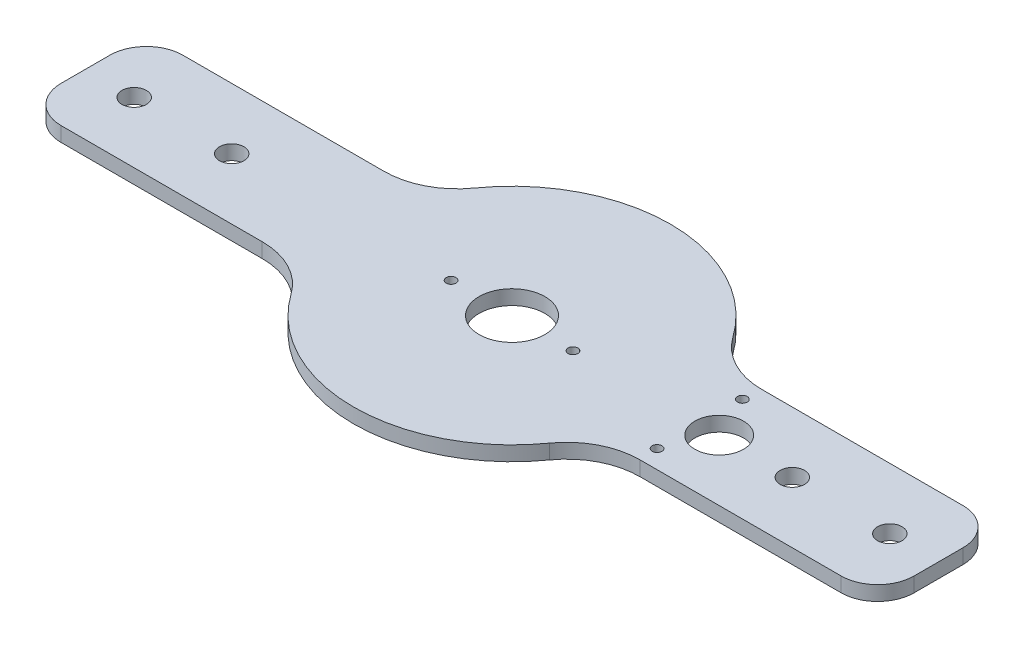
ISO-10303-21;
HEADER;
FILE_DESCRIPTION(('STEP AP214'),'2;1');
FILE_NAME('part.step','',(''),(''),'','','');
FILE_SCHEMA(('AUTOMOTIVE_DESIGN { 1 0 10303 214 1 1 1 1 }'));
ENDSEC;
DATA;
#1=APPLICATION_CONTEXT('core data for automotive mechanical design processes');
#2=APPLICATION_PROTOCOL_DEFINITION('international standard','automotive_design',2000,#1);
#3=PRODUCT_CONTEXT('',#1,'mechanical');
#4=PRODUCT('Part','Part','',(#3));
#5=PRODUCT_RELATED_PRODUCT_CATEGORY('part','',(#4));
#6=PRODUCT_DEFINITION_FORMATION('','',#4);
#7=PRODUCT_DEFINITION_CONTEXT('part definition',#1,'design');
#8=PRODUCT_DEFINITION('design','',#6,#7);
#9=PRODUCT_DEFINITION_SHAPE('','',#8);
#10=(LENGTH_UNIT() NAMED_UNIT(*) SI_UNIT(.MILLI.,.METRE.));
#11=(NAMED_UNIT(*) PLANE_ANGLE_UNIT() SI_UNIT($,.RADIAN.));
#12=(NAMED_UNIT(*) SI_UNIT($,.STERADIAN.) SOLID_ANGLE_UNIT());
#13=UNCERTAINTY_MEASURE_WITH_UNIT(LENGTH_MEASURE(1.E-05),#10,'distance_accuracy_value','');
#14=(GEOMETRIC_REPRESENTATION_CONTEXT(3) GLOBAL_UNCERTAINTY_ASSIGNED_CONTEXT((#13)) GLOBAL_UNIT_ASSIGNED_CONTEXT((#10,
#11,#12)) REPRESENTATION_CONTEXT('',''));
#15=CARTESIAN_POINT('',(0.,0.,0.));
#16=DIRECTION('',(0.,0.,1.));
#17=DIRECTION('',(1.,0.,0.));
#18=AXIS2_PLACEMENT_3D('',#15,#16,#17);
#19=CARTESIAN_POINT('',(-77.4596669241483,6.,-55.));
#20=DIRECTION('',(0.,-1.,0.));
#21=DIRECTION('',(0.,0.,-1.));
#22=AXIS2_PLACEMENT_3D('',#19,#20,#21);
#23=PLANE('',#22);
#24=CARTESIAN_POINT('',(77.,6.,-17.5));
#25=DIRECTION('',(0.,1.,0.));
#26=DIRECTION('',(0.,0.,1.));
#27=AXIS2_PLACEMENT_3D('',#24,#25,#26);
#28=CIRCLE('',#27,2.);
#29=CARTESIAN_POINT('',(77.,6.,-15.5));
#30=VERTEX_POINT('',#29);
#31=EDGE_CURVE('E382',#30,#30,#28,.T.);
#32=ORIENTED_EDGE('',*,*,#31,.F.);
#33=EDGE_LOOP('',(#32));
#34=FACE_BOUND('',#33,.T.);
#35=CARTESIAN_POINT('',(-25.,6.,0.));
#36=DIRECTION('',(0.,1.,0.));
#37=DIRECTION('',(0.,0.,1.));
#38=AXIS2_PLACEMENT_3D('',#35,#36,#37);
#39=CIRCLE('',#38,2.);
#40=CARTESIAN_POINT('',(-25.,6.,2.00000000000001));
#41=VERTEX_POINT('',#40);
#42=EDGE_CURVE('E394',#41,#41,#39,.T.);
#43=ORIENTED_EDGE('',*,*,#42,.F.);
#44=EDGE_LOOP('',(#43));
#45=FACE_BOUND('',#44,.T.);
#46=CARTESIAN_POINT('',(115.,6.,0.));
#47=DIRECTION('',(0.,1.,0.));
#48=DIRECTION('',(0.,0.,-1.));
#49=AXIS2_PLACEMENT_3D('',#46,#47,#48);
#50=CIRCLE('',#49,4.99999999999999);
#51=CARTESIAN_POINT('',(115.,6.,-5.));
#52=VERTEX_POINT('',#51);
#53=EDGE_CURVE('E406',#52,#52,#50,.T.);
#54=ORIENTED_EDGE('',*,*,#53,.F.);
#55=EDGE_LOOP('',(#54));
#56=FACE_BOUND('',#55,.T.);
#57=CARTESIAN_POINT('',(-155.,6.,0.));
#58=DIRECTION('',(0.,1.,0.));
#59=DIRECTION('',(0.,0.,1.));
#60=AXIS2_PLACEMENT_3D('',#57,#58,#59);
#61=CIRCLE('',#60,4.99999999999999);
#62=CARTESIAN_POINT('',(-155.,6.,5.00000000000001));
#63=VERTEX_POINT('',#62);
#64=EDGE_CURVE('E418',#63,#63,#61,.T.);
#65=ORIENTED_EDGE('',*,*,#64,.F.);
#66=EDGE_LOOP('',(#65));
#67=FACE_BOUND('',#66,.T.);
#68=CARTESIAN_POINT('',(0.,6.,0.));
#69=DIRECTION('',(0.,1.,0.));
#70=DIRECTION('',(0.,0.,1.));
#71=AXIS2_PLACEMENT_3D('',#68,#69,#70);
#72=CIRCLE('',#71,13.5);
#73=CARTESIAN_POINT('',(0.,6.,13.5));
#74=VERTEX_POINT('',#73);
#75=EDGE_CURVE('E196',#74,#74,#72,.T.);
#76=ORIENTED_EDGE('',*,*,#75,.F.);
#77=EDGE_LOOP('',(#76));
#78=FACE_BOUND('',#77,.T.);
#79=CARTESIAN_POINT('',(-77.4596669241483,6.,-55.));
#80=DIRECTION('',(0.,-1.,0.));
#81=DIRECTION('',(0.,0.,-1.));
#82=AXIS2_PLACEMENT_3D('',#79,#80,#81);
#83=CIRCLE('',#82,30.);
#84=CARTESIAN_POINT('',(-52.9987194744173,6.,-37.6315789473684));
#85=VERTEX_POINT('',#84);
#86=CARTESIAN_POINT('',(-77.4596669241483,6.,-25.));
#87=VERTEX_POINT('',#86);
#88=EDGE_CURVE('E223',#85,#87,#83,.T.);
#89=ORIENTED_EDGE('',*,*,#88,.T.);
#90=DIRECTION('',(-1.,0.,0.));
#91=VECTOR('',#90,1.);
#92=CARTESIAN_POINT('',(-160.,6.,-25.));
#93=LINE('',#92,#91);
#94=CARTESIAN_POINT('',(-160.,6.,-25.));
#95=VERTEX_POINT('',#94);
#96=EDGE_CURVE('E131',#87,#95,#93,.T.);
#97=ORIENTED_EDGE('',*,*,#96,.T.);
#98=CARTESIAN_POINT('',(-160.,6.,-10.));
#99=DIRECTION('',(0.,1.,0.));
#100=DIRECTION('',(0.,0.,1.));
#101=AXIS2_PLACEMENT_3D('',#98,#99,#100);
#102=CIRCLE('',#101,15.);
#103=CARTESIAN_POINT('',(-175.,6.,-10.));
#104=VERTEX_POINT('',#103);
#105=EDGE_CURVE('E262',#95,#104,#102,.T.);
#106=ORIENTED_EDGE('',*,*,#105,.T.);
#107=DIRECTION('',(0.,0.,1.));
#108=VECTOR('',#107,1.);
#109=CARTESIAN_POINT('',(-175.,6.,-10.));
#110=LINE('',#109,#108);
#111=CARTESIAN_POINT('',(-175.,6.,10.));
#112=VERTEX_POINT('',#111);
#113=EDGE_CURVE('E281',#104,#112,#110,.T.);
#114=ORIENTED_EDGE('',*,*,#113,.T.);
#115=CARTESIAN_POINT('',(-160.,6.,10.));
#116=DIRECTION('',(0.,1.,0.));
#117=DIRECTION('',(0.,0.,-1.));
#118=AXIS2_PLACEMENT_3D('',#115,#116,#117);
#119=CIRCLE('',#118,15.);
#120=CARTESIAN_POINT('',(-160.,6.,25.));
#121=VERTEX_POINT('',#120);
#122=EDGE_CURVE('E278',#112,#121,#119,.T.);
#123=ORIENTED_EDGE('',*,*,#122,.T.);
#124=DIRECTION('',(1.,0.,0.));
#125=VECTOR('',#124,1.);
#126=CARTESIAN_POINT('',(-160.,6.,25.));
#127=LINE('',#126,#125);
#128=CARTESIAN_POINT('',(-77.4596669241483,6.,25.));
#129=VERTEX_POINT('',#128);
#130=EDGE_CURVE('E280',#121,#129,#127,.T.);
#131=ORIENTED_EDGE('',*,*,#130,.T.);
#132=CARTESIAN_POINT('',(-77.4596669241483,6.,55.));
#133=DIRECTION('',(0.,-1.,0.));
#134=DIRECTION('',(0.,0.,1.));
#135=AXIS2_PLACEMENT_3D('',#132,#133,#134);
#136=CIRCLE('',#135,30.);
#137=CARTESIAN_POINT('',(-52.9987194744173,6.,37.6315789473684));
#138=VERTEX_POINT('',#137);
#139=EDGE_CURVE('E283',#129,#138,#136,.T.);
#140=ORIENTED_EDGE('',*,*,#139,.T.);
#141=CARTESIAN_POINT('',(0.,6.,0.));
#142=DIRECTION('',(0.,1.,0.));
#143=DIRECTION('',(0.,0.,1.));
#144=AXIS2_PLACEMENT_3D('',#141,#142,#143);
#145=CIRCLE('',#144,65.);
#146=CARTESIAN_POINT('',(52.9987194744173,6.,37.6315789473684));
#147=VERTEX_POINT('',#146);
#148=EDGE_CURVE('E289',#138,#147,#145,.T.);
#149=ORIENTED_EDGE('',*,*,#148,.T.);
#150=CARTESIAN_POINT('',(77.4596669241483,6.,55.));
#151=DIRECTION('',(0.,-1.,0.));
#152=DIRECTION('',(0.,0.,1.));
#153=AXIS2_PLACEMENT_3D('',#150,#151,#152);
#154=CIRCLE('',#153,30.);
#155=CARTESIAN_POINT('',(77.4596669241483,6.,25.));
#156=VERTEX_POINT('',#155);
#157=EDGE_CURVE('E291',#147,#156,#154,.T.);
#158=ORIENTED_EDGE('',*,*,#157,.T.);
#159=DIRECTION('',(1.,0.,0.));
#160=VECTOR('',#159,1.);
#161=CARTESIAN_POINT('',(77.4596669241483,6.,25.));
#162=LINE('',#161,#160);
#163=CARTESIAN_POINT('',(160.,6.,25.));
#164=VERTEX_POINT('',#163);
#165=EDGE_CURVE('E293',#156,#164,#162,.T.);
#166=ORIENTED_EDGE('',*,*,#165,.T.);
#167=CARTESIAN_POINT('',(160.,6.,10.));
#168=DIRECTION('',(0.,1.,0.));
#169=DIRECTION('',(0.,0.,-1.));
#170=AXIS2_PLACEMENT_3D('',#167,#168,#169);
#171=CIRCLE('',#170,15.);
#172=CARTESIAN_POINT('',(175.,6.,10.));
#173=VERTEX_POINT('',#172);
#174=EDGE_CURVE('E295',#164,#173,#171,.T.);
#175=ORIENTED_EDGE('',*,*,#174,.T.);
#176=DIRECTION('',(0.,0.,-1.));
#177=VECTOR('',#176,1.);
#178=CARTESIAN_POINT('',(175.,6.,-10.));
#179=LINE('',#178,#177);
#180=CARTESIAN_POINT('',(175.,6.,-10.));
#181=VERTEX_POINT('',#180);
#182=EDGE_CURVE('E297',#173,#181,#179,.T.);
#183=ORIENTED_EDGE('',*,*,#182,.T.);
#184=CARTESIAN_POINT('',(160.,6.,-10.));
#185=DIRECTION('',(0.,1.,0.));
#186=DIRECTION('',(0.,0.,1.));
#187=AXIS2_PLACEMENT_3D('',#184,#185,#186);
#188=CIRCLE('',#187,15.);
#189=CARTESIAN_POINT('',(160.,6.,-25.));
#190=VERTEX_POINT('',#189);
#191=EDGE_CURVE('E174',#181,#190,#188,.T.);
#192=ORIENTED_EDGE('',*,*,#191,.T.);
#193=DIRECTION('',(-1.,0.,0.));
#194=VECTOR('',#193,1.);
#195=CARTESIAN_POINT('',(77.4596669241483,6.,-25.));
#196=LINE('',#195,#194);
#197=CARTESIAN_POINT('',(77.4596669241483,6.,-25.));
#198=VERTEX_POINT('',#197);
#199=EDGE_CURVE('E168',#190,#198,#196,.T.);
#200=ORIENTED_EDGE('',*,*,#199,.T.);
#201=CARTESIAN_POINT('',(77.4596669241483,6.,-55.));
#202=DIRECTION('',(0.,-1.,0.));
#203=DIRECTION('',(0.,0.,-1.));
#204=AXIS2_PLACEMENT_3D('',#201,#202,#203);
#205=CIRCLE('',#204,30.);
#206=CARTESIAN_POINT('',(52.9987194744173,6.,-37.6315789473684));
#207=VERTEX_POINT('',#206);
#208=EDGE_CURVE('E172',#198,#207,#205,.T.);
#209=ORIENTED_EDGE('',*,*,#208,.T.);
#210=CARTESIAN_POINT('',(0.,6.,0.));
#211=DIRECTION('',(0.,1.,0.));
#212=DIRECTION('',(0.,0.,1.));
#213=AXIS2_PLACEMENT_3D('',#210,#211,#212);
#214=CIRCLE('',#213,65.);
#215=EDGE_CURVE('E64',#207,#85,#214,.T.);
#216=ORIENTED_EDGE('',*,*,#215,.T.);
#217=EDGE_LOOP('',(#89,#97,#106,#114,#123,#131,#140,#149,#158,#166,#175,#183,#192,#200,#209,#216));
#218=FACE_BOUND('',#217,.T.);
#219=CARTESIAN_POINT('',(-115.,6.,0.));
#220=DIRECTION('',(0.,1.,0.));
#221=DIRECTION('',(0.,0.,1.));
#222=AXIS2_PLACEMENT_3D('',#219,#220,#221);
#223=CIRCLE('',#222,4.99999999999999);
#224=CARTESIAN_POINT('',(-115.,6.,5.));
#225=VERTEX_POINT('',#224);
#226=EDGE_CURVE('E424',#225,#225,#223,.T.);
#227=ORIENTED_EDGE('',*,*,#226,.F.);
#228=EDGE_LOOP('',(#227));
#229=FACE_BOUND('',#228,.T.);
#230=CARTESIAN_POINT('',(155.,6.,0.));
#231=DIRECTION('',(0.,1.,0.));
#232=DIRECTION('',(0.,0.,-1.));
#233=AXIS2_PLACEMENT_3D('',#230,#231,#232);
#234=CIRCLE('',#233,4.99999999999999);
#235=CARTESIAN_POINT('',(155.,6.,-5.00000000000001));
#236=VERTEX_POINT('',#235);
#237=EDGE_CURVE('E412',#236,#236,#234,.T.);
#238=ORIENTED_EDGE('',*,*,#237,.F.);
#239=EDGE_LOOP('',(#238));
#240=FACE_BOUND('',#239,.T.);
#241=CARTESIAN_POINT('',(85.,6.,0.));
#242=DIRECTION('',(0.,1.,0.));
#243=DIRECTION('',(0.,0.,1.));
#244=AXIS2_PLACEMENT_3D('',#241,#242,#243);
#245=CIRCLE('',#244,9.99999999999999);
#246=CARTESIAN_POINT('',(85.,6.,9.99999999999999));
#247=VERTEX_POINT('',#246);
#248=EDGE_CURVE('E400',#247,#247,#245,.T.);
#249=ORIENTED_EDGE('',*,*,#248,.F.);
#250=EDGE_LOOP('',(#249));
#251=FACE_BOUND('',#250,.T.);
#252=CARTESIAN_POINT('',(25.,6.,0.));
#253=DIRECTION('',(0.,1.,0.));
#254=DIRECTION('',(0.,0.,-1.));
#255=AXIS2_PLACEMENT_3D('',#252,#253,#254);
#256=CIRCLE('',#255,2.);
#257=CARTESIAN_POINT('',(25.,6.,-2.));
#258=VERTEX_POINT('',#257);
#259=EDGE_CURVE('E388',#258,#258,#256,.T.);
#260=ORIENTED_EDGE('',*,*,#259,.F.);
#261=EDGE_LOOP('',(#260));
#262=FACE_BOUND('',#261,.T.);
#263=CARTESIAN_POINT('',(77.,6.,17.5));
#264=DIRECTION('',(0.,1.,0.));
#265=DIRECTION('',(0.,0.,-1.));
#266=AXIS2_PLACEMENT_3D('',#263,#264,#265);
#267=CIRCLE('',#266,2.);
#268=CARTESIAN_POINT('',(77.,6.,15.5));
#269=VERTEX_POINT('',#268);
#270=EDGE_CURVE('E373',#269,#269,#267,.T.);
#271=ORIENTED_EDGE('',*,*,#270,.F.);
#272=EDGE_LOOP('',(#271));
#273=FACE_BOUND('',#272,.T.);
#274=ADVANCED_FACE('F47',(#34,#45,#56,#67,#78,#218,#229,#240,#251,#262,#273),#23,.F.);
#275=CARTESIAN_POINT('',(-77.4596669241483,0.,-55.));
#276=DIRECTION('',(0.,-1.,0.));
#277=DIRECTION('',(0.,0.,-1.));
#278=AXIS2_PLACEMENT_3D('',#275,#276,#277);
#279=PLANE('',#278);
#280=CARTESIAN_POINT('',(77.,0.,-17.5));
#281=DIRECTION('',(0.,1.,0.));
#282=DIRECTION('',(0.,0.,1.));
#283=AXIS2_PLACEMENT_3D('',#280,#281,#282);
#284=CIRCLE('',#283,2.);
#285=CARTESIAN_POINT('',(77.,0.,-15.5));
#286=VERTEX_POINT('',#285);
#287=EDGE_CURVE('E379',#286,#286,#284,.T.);
#288=ORIENTED_EDGE('',*,*,#287,.T.);
#289=EDGE_LOOP('',(#288));
#290=FACE_BOUND('',#289,.T.);
#291=CARTESIAN_POINT('',(-25.,0.,0.));
#292=DIRECTION('',(0.,1.,0.));
#293=DIRECTION('',(0.,0.,1.));
#294=AXIS2_PLACEMENT_3D('',#291,#292,#293);
#295=CIRCLE('',#294,2.);
#296=CARTESIAN_POINT('',(-25.,0.,2.00000000000001));
#297=VERTEX_POINT('',#296);
#298=EDGE_CURVE('E391',#297,#297,#295,.T.);
#299=ORIENTED_EDGE('',*,*,#298,.T.);
#300=EDGE_LOOP('',(#299));
#301=FACE_BOUND('',#300,.T.);
#302=CARTESIAN_POINT('',(115.,0.,0.));
#303=DIRECTION('',(0.,1.,0.));
#304=DIRECTION('',(0.,0.,-1.));
#305=AXIS2_PLACEMENT_3D('',#302,#303,#304);
#306=CIRCLE('',#305,4.99999999999999);
#307=CARTESIAN_POINT('',(115.,0.,-5.));
#308=VERTEX_POINT('',#307);
#309=EDGE_CURVE('E403',#308,#308,#306,.T.);
#310=ORIENTED_EDGE('',*,*,#309,.T.);
#311=EDGE_LOOP('',(#310));
#312=FACE_BOUND('',#311,.T.);
#313=CARTESIAN_POINT('',(-155.,0.,0.));
#314=DIRECTION('',(0.,1.,0.));
#315=DIRECTION('',(0.,0.,1.));
#316=AXIS2_PLACEMENT_3D('',#313,#314,#315);
#317=CIRCLE('',#316,4.99999999999999);
#318=CARTESIAN_POINT('',(-155.,0.,5.00000000000001));
#319=VERTEX_POINT('',#318);
#320=EDGE_CURVE('E415',#319,#319,#317,.T.);
#321=ORIENTED_EDGE('',*,*,#320,.T.);
#322=EDGE_LOOP('',(#321));
#323=FACE_BOUND('',#322,.T.);
#324=CARTESIAN_POINT('',(0.,0.,0.));
#325=DIRECTION('',(0.,1.,0.));
#326=DIRECTION('',(0.,0.,1.));
#327=AXIS2_PLACEMENT_3D('',#324,#325,#326);
#328=CIRCLE('',#327,13.5);
#329=CARTESIAN_POINT('',(0.,0.,13.5));
#330=VERTEX_POINT('',#329);
#331=EDGE_CURVE('E427',#330,#330,#328,.T.);
#332=ORIENTED_EDGE('',*,*,#331,.T.);
#333=EDGE_LOOP('',(#332));
#334=FACE_BOUND('',#333,.T.);
#335=CARTESIAN_POINT('',(-77.4596669241483,0.,-55.));
#336=DIRECTION('',(0.,-1.,0.));
#337=DIRECTION('',(0.,0.,-1.));
#338=AXIS2_PLACEMENT_3D('',#335,#336,#337);
#339=CIRCLE('',#338,30.);
#340=CARTESIAN_POINT('',(-52.9987194744173,0.,-37.6315789473684));
#341=VERTEX_POINT('',#340);
#342=CARTESIAN_POINT('',(-77.4596669241483,0.,-25.));
#343=VERTEX_POINT('',#342);
#344=EDGE_CURVE('E192',#341,#343,#339,.T.);
#345=ORIENTED_EDGE('',*,*,#344,.F.);
#346=CARTESIAN_POINT('',(0.,0.,0.));
#347=DIRECTION('',(0.,1.,0.));
#348=DIRECTION('',(0.,0.,1.));
#349=AXIS2_PLACEMENT_3D('',#346,#347,#348);
#350=CIRCLE('',#349,65.);
#351=CARTESIAN_POINT('',(52.9987194744173,0.,-37.6315789473684));
#352=VERTEX_POINT('',#351);
#353=EDGE_CURVE('E123',#352,#341,#350,.T.);
#354=ORIENTED_EDGE('',*,*,#353,.F.);
#355=CARTESIAN_POINT('',(77.4596669241483,0.,-55.));
#356=DIRECTION('',(0.,-1.,0.));
#357=DIRECTION('',(0.,0.,-1.));
#358=AXIS2_PLACEMENT_3D('',#355,#356,#357);
#359=CIRCLE('',#358,30.);
#360=CARTESIAN_POINT('',(77.4596669241483,0.,-25.));
#361=VERTEX_POINT('',#360);
#362=EDGE_CURVE('E117',#361,#352,#359,.T.);
#363=ORIENTED_EDGE('',*,*,#362,.F.);
#364=DIRECTION('',(-1.,0.,0.));
#365=VECTOR('',#364,1.);
#366=CARTESIAN_POINT('',(77.4596669241483,0.,-25.));
#367=LINE('',#366,#365);
#368=CARTESIAN_POINT('',(160.,0.,-25.));
#369=VERTEX_POINT('',#368);
#370=EDGE_CURVE('E182',#369,#361,#367,.T.);
#371=ORIENTED_EDGE('',*,*,#370,.F.);
#372=CARTESIAN_POINT('',(160.,0.,-10.));
#373=DIRECTION('',(0.,1.,0.));
#374=DIRECTION('',(0.,0.,1.));
#375=AXIS2_PLACEMENT_3D('',#372,#373,#374);
#376=CIRCLE('',#375,15.);
#377=CARTESIAN_POINT('',(175.,0.,-10.));
#378=VERTEX_POINT('',#377);
#379=EDGE_CURVE('E218',#378,#369,#376,.T.);
#380=ORIENTED_EDGE('',*,*,#379,.F.);
#381=DIRECTION('',(0.,0.,-1.));
#382=VECTOR('',#381,1.);
#383=CARTESIAN_POINT('',(175.,0.,-10.));
#384=LINE('',#383,#382);
#385=CARTESIAN_POINT('',(175.,0.,10.));
#386=VERTEX_POINT('',#385);
#387=EDGE_CURVE('E216',#386,#378,#384,.T.);
#388=ORIENTED_EDGE('',*,*,#387,.F.);
#389=CARTESIAN_POINT('',(160.,0.,10.));
#390=DIRECTION('',(0.,1.,0.));
#391=DIRECTION('',(0.,0.,-1.));
#392=AXIS2_PLACEMENT_3D('',#389,#390,#391);
#393=CIRCLE('',#392,15.);
#394=CARTESIAN_POINT('',(160.,0.,25.));
#395=VERTEX_POINT('',#394);
#396=EDGE_CURVE('E214',#395,#386,#393,.T.);
#397=ORIENTED_EDGE('',*,*,#396,.F.);
#398=DIRECTION('',(1.,0.,0.));
#399=VECTOR('',#398,1.);
#400=CARTESIAN_POINT('',(77.4596669241483,0.,25.));
#401=LINE('',#400,#399);
#402=CARTESIAN_POINT('',(77.4596669241483,0.,25.));
#403=VERTEX_POINT('',#402);
#404=EDGE_CURVE('E212',#403,#395,#401,.T.);
#405=ORIENTED_EDGE('',*,*,#404,.F.);
#406=CARTESIAN_POINT('',(77.4596669241483,0.,55.));
#407=DIRECTION('',(0.,-1.,0.));
#408=DIRECTION('',(0.,0.,1.));
#409=AXIS2_PLACEMENT_3D('',#406,#407,#408);
#410=CIRCLE('',#409,30.);
#411=CARTESIAN_POINT('',(52.9987194744173,0.,37.6315789473684));
#412=VERTEX_POINT('',#411);
#413=EDGE_CURVE('E210',#412,#403,#410,.T.);
#414=ORIENTED_EDGE('',*,*,#413,.F.);
#415=CARTESIAN_POINT('',(0.,0.,0.));
#416=DIRECTION('',(0.,1.,0.));
#417=DIRECTION('',(0.,0.,1.));
#418=AXIS2_PLACEMENT_3D('',#415,#416,#417);
#419=CIRCLE('',#418,65.);
#420=CARTESIAN_POINT('',(-52.9987194744173,0.,37.6315789473684));
#421=VERTEX_POINT('',#420);
#422=EDGE_CURVE('E208',#421,#412,#419,.T.);
#423=ORIENTED_EDGE('',*,*,#422,.F.);
#424=CARTESIAN_POINT('',(-77.4596669241483,0.,55.));
#425=DIRECTION('',(0.,-1.,0.));
#426=DIRECTION('',(0.,0.,1.));
#427=AXIS2_PLACEMENT_3D('',#424,#425,#426);
#428=CIRCLE('',#427,30.);
#429=CARTESIAN_POINT('',(-77.4596669241483,0.,25.));
#430=VERTEX_POINT('',#429);
#431=EDGE_CURVE('E206',#430,#421,#428,.T.);
#432=ORIENTED_EDGE('',*,*,#431,.F.);
#433=DIRECTION('',(1.,0.,0.));
#434=VECTOR('',#433,1.);
#435=CARTESIAN_POINT('',(-160.,0.,25.));
#436=LINE('',#435,#434);
#437=CARTESIAN_POINT('',(-160.,0.,25.));
#438=VERTEX_POINT('',#437);
#439=EDGE_CURVE('E204',#438,#430,#436,.T.);
#440=ORIENTED_EDGE('',*,*,#439,.F.);
#441=CARTESIAN_POINT('',(-160.,0.,10.));
#442=DIRECTION('',(0.,1.,0.));
#443=DIRECTION('',(0.,0.,-1.));
#444=AXIS2_PLACEMENT_3D('',#441,#442,#443);
#445=CIRCLE('',#444,15.);
#446=CARTESIAN_POINT('',(-175.,0.,10.));
#447=VERTEX_POINT('',#446);
#448=EDGE_CURVE('E202',#447,#438,#445,.T.);
#449=ORIENTED_EDGE('',*,*,#448,.F.);
#450=DIRECTION('',(0.,0.,1.));
#451=VECTOR('',#450,1.);
#452=CARTESIAN_POINT('',(-175.,0.,-10.));
#453=LINE('',#452,#451);
#454=CARTESIAN_POINT('',(-175.,0.,-10.));
#455=VERTEX_POINT('',#454);
#456=EDGE_CURVE('E200',#455,#447,#453,.T.);
#457=ORIENTED_EDGE('',*,*,#456,.F.);
#458=CARTESIAN_POINT('',(-160.,0.,-10.));
#459=DIRECTION('',(0.,1.,0.));
#460=DIRECTION('',(0.,0.,1.));
#461=AXIS2_PLACEMENT_3D('',#458,#459,#460);
#462=CIRCLE('',#461,15.);
#463=CARTESIAN_POINT('',(-160.,0.,-25.));
#464=VERTEX_POINT('',#463);
#465=EDGE_CURVE('E198',#464,#455,#462,.T.);
#466=ORIENTED_EDGE('',*,*,#465,.F.);
#467=DIRECTION('',(-1.,0.,0.));
#468=VECTOR('',#467,1.);
#469=CARTESIAN_POINT('',(-160.,0.,-25.));
#470=LINE('',#469,#468);
#471=EDGE_CURVE('E195',#343,#464,#470,.T.);
#472=ORIENTED_EDGE('',*,*,#471,.F.);
#473=EDGE_LOOP('',(#345,#354,#363,#371,#380,#388,#397,#405,#414,#423,#432,#440,#449,#457,#466,#472));
#474=FACE_BOUND('',#473,.T.);
#475=CARTESIAN_POINT('',(-115.,0.,0.));
#476=DIRECTION('',(0.,1.,0.));
#477=DIRECTION('',(0.,0.,1.));
#478=AXIS2_PLACEMENT_3D('',#475,#476,#477);
#479=CIRCLE('',#478,4.99999999999999);
#480=CARTESIAN_POINT('',(-115.,0.,5.));
#481=VERTEX_POINT('',#480);
#482=EDGE_CURVE('E421',#481,#481,#479,.T.);
#483=ORIENTED_EDGE('',*,*,#482,.T.);
#484=EDGE_LOOP('',(#483));
#485=FACE_BOUND('',#484,.T.);
#486=CARTESIAN_POINT('',(155.,0.,0.));
#487=DIRECTION('',(0.,1.,0.));
#488=DIRECTION('',(0.,0.,-1.));
#489=AXIS2_PLACEMENT_3D('',#486,#487,#488);
#490=CIRCLE('',#489,4.99999999999999);
#491=CARTESIAN_POINT('',(155.,0.,-5.00000000000001));
#492=VERTEX_POINT('',#491);
#493=EDGE_CURVE('E409',#492,#492,#490,.T.);
#494=ORIENTED_EDGE('',*,*,#493,.T.);
#495=EDGE_LOOP('',(#494));
#496=FACE_BOUND('',#495,.T.);
#497=CARTESIAN_POINT('',(85.,0.,0.));
#498=DIRECTION('',(0.,1.,0.));
#499=DIRECTION('',(0.,0.,1.));
#500=AXIS2_PLACEMENT_3D('',#497,#498,#499);
#501=CIRCLE('',#500,9.99999999999999);
#502=CARTESIAN_POINT('',(85.,0.,9.99999999999999));
#503=VERTEX_POINT('',#502);
#504=EDGE_CURVE('E397',#503,#503,#501,.T.);
#505=ORIENTED_EDGE('',*,*,#504,.T.);
#506=EDGE_LOOP('',(#505));
#507=FACE_BOUND('',#506,.T.);
#508=CARTESIAN_POINT('',(25.,0.,0.));
#509=DIRECTION('',(0.,1.,0.));
#510=DIRECTION('',(0.,0.,-1.));
#511=AXIS2_PLACEMENT_3D('',#508,#509,#510);
#512=CIRCLE('',#511,2.);
#513=CARTESIAN_POINT('',(25.,0.,-2.));
#514=VERTEX_POINT('',#513);
#515=EDGE_CURVE('E385',#514,#514,#512,.T.);
#516=ORIENTED_EDGE('',*,*,#515,.T.);
#517=EDGE_LOOP('',(#516));
#518=FACE_BOUND('',#517,.T.);
#519=CARTESIAN_POINT('',(77.,0.,17.5));
#520=DIRECTION('',(0.,1.,0.));
#521=DIRECTION('',(0.,0.,-1.));
#522=AXIS2_PLACEMENT_3D('',#519,#520,#521);
#523=CIRCLE('',#522,2.);
#524=CARTESIAN_POINT('',(77.,0.,15.5));
#525=VERTEX_POINT('',#524);
#526=EDGE_CURVE('E376',#525,#525,#523,.T.);
#527=ORIENTED_EDGE('',*,*,#526,.T.);
#528=EDGE_LOOP('',(#527));
#529=FACE_BOUND('',#528,.T.);
#530=ADVANCED_FACE('F266',(#290,#301,#312,#323,#334,#474,#485,#496,#507,#518,#529),#279,.T.);
#531=CARTESIAN_POINT('',(-77.4596669241483,6.,-55.));
#532=DIRECTION('',(0.,-1.,0.));
#533=DIRECTION('',(0.,0.,-1.));
#534=AXIS2_PLACEMENT_3D('',#531,#532,#533);
#535=CYLINDRICAL_SURFACE('',#534,30.);
#536=ORIENTED_EDGE('',*,*,#344,.T.);
#537=DIRECTION('',(0.,-1.,0.));
#538=VECTOR('',#537,1.);
#539=CARTESIAN_POINT('',(-77.4596669241483,6.,-25.));
#540=LINE('',#539,#538);
#541=EDGE_CURVE('E13',#87,#343,#540,.T.);
#542=ORIENTED_EDGE('',*,*,#541,.F.);
#543=ORIENTED_EDGE('',*,*,#88,.F.);
#544=DIRECTION('',(0.,-1.,0.));
#545=VECTOR('',#544,1.);
#546=CARTESIAN_POINT('',(-52.9987194744173,6.,-37.6315789473684));
#547=LINE('',#546,#545);
#548=EDGE_CURVE('E188',#85,#341,#547,.T.);
#549=ORIENTED_EDGE('',*,*,#548,.T.);
#550=EDGE_LOOP('',(#536,#542,#543,#549));
#551=FACE_BOUND('',#550,.T.);
#552=ADVANCED_FACE('F49',(#551),#535,.F.);
#553=CARTESIAN_POINT('',(-160.,6.,-25.));
#554=DIRECTION('',(0.,0.,1.));
#555=DIRECTION('',(1.,0.,0.));
#556=AXIS2_PLACEMENT_3D('',#553,#554,#555);
#557=PLANE('',#556);
#558=ORIENTED_EDGE('',*,*,#471,.T.);
#559=DIRECTION('',(0.,-1.,0.));
#560=VECTOR('',#559,1.);
#561=CARTESIAN_POINT('',(-160.,6.,-25.));
#562=LINE('',#561,#560);
#563=EDGE_CURVE('E56',#95,#464,#562,.T.);
#564=ORIENTED_EDGE('',*,*,#563,.F.);
#565=ORIENTED_EDGE('',*,*,#96,.F.);
#566=ORIENTED_EDGE('',*,*,#541,.T.);
#567=EDGE_LOOP('',(#558,#564,#565,#566));
#568=FACE_BOUND('',#567,.T.);
#569=ADVANCED_FACE('F630',(#568),#557,.F.);
#570=CARTESIAN_POINT('',(-160.,6.,-10.));
#571=DIRECTION('',(0.,-1.,0.));
#572=DIRECTION('',(0.,0.,-1.));
#573=AXIS2_PLACEMENT_3D('',#570,#571,#572);
#574=CYLINDRICAL_SURFACE('',#573,15.);
#575=ORIENTED_EDGE('',*,*,#465,.T.);
#576=DIRECTION('',(0.,-1.,0.));
#577=VECTOR('',#576,1.);
#578=CARTESIAN_POINT('',(-175.,6.,-10.));
#579=LINE('',#578,#577);
#580=EDGE_CURVE('E254',#104,#455,#579,.T.);
#581=ORIENTED_EDGE('',*,*,#580,.F.);
#582=ORIENTED_EDGE('',*,*,#105,.F.);
#583=ORIENTED_EDGE('',*,*,#563,.T.);
#584=EDGE_LOOP('',(#575,#581,#582,#583));
#585=FACE_BOUND('',#584,.T.);
#586=ADVANCED_FACE('F260',(#585),#574,.T.);
#587=CARTESIAN_POINT('',(-175.,6.,-10.));
#588=DIRECTION('',(1.,0.,0.));
#589=DIRECTION('',(0.,0.,-1.));
#590=AXIS2_PLACEMENT_3D('',#587,#588,#589);
#591=PLANE('',#590);
#592=ORIENTED_EDGE('',*,*,#456,.T.);
#593=DIRECTION('',(0.,-1.,0.));
#594=VECTOR('',#593,1.);
#595=CARTESIAN_POINT('',(-175.,6.,10.));
#596=LINE('',#595,#594);
#597=EDGE_CURVE('E251',#112,#447,#596,.T.);
#598=ORIENTED_EDGE('',*,*,#597,.F.);
#599=ORIENTED_EDGE('',*,*,#113,.F.);
#600=ORIENTED_EDGE('',*,*,#580,.T.);
#601=EDGE_LOOP('',(#592,#598,#599,#600));
#602=FACE_BOUND('',#601,.T.);
#603=ADVANCED_FACE('F272',(#602),#591,.F.);
#604=CARTESIAN_POINT('',(-160.,6.,10.));
#605=DIRECTION('',(0.,-1.,0.));
#606=DIRECTION('',(0.,0.,-1.));
#607=AXIS2_PLACEMENT_3D('',#604,#605,#606);
#608=CYLINDRICAL_SURFACE('',#607,15.);
#609=ORIENTED_EDGE('',*,*,#448,.T.);
#610=DIRECTION('',(0.,-1.,0.));
#611=VECTOR('',#610,1.);
#612=CARTESIAN_POINT('',(-160.,6.,25.));
#613=LINE('',#612,#611);
#614=EDGE_CURVE('E248',#121,#438,#613,.T.);
#615=ORIENTED_EDGE('',*,*,#614,.F.);
#616=ORIENTED_EDGE('',*,*,#122,.F.);
#617=ORIENTED_EDGE('',*,*,#597,.T.);
#618=EDGE_LOOP('',(#609,#615,#616,#617));
#619=FACE_BOUND('',#618,.T.);
#620=ADVANCED_FACE('F276',(#619),#608,.T.);
#621=CARTESIAN_POINT('',(-160.,6.,25.));
#622=DIRECTION('',(0.,0.,-1.));
#623=DIRECTION('',(-1.,0.,0.));
#624=AXIS2_PLACEMENT_3D('',#621,#622,#623);
#625=PLANE('',#624);
#626=ORIENTED_EDGE('',*,*,#439,.T.);
#627=DIRECTION('',(0.,-1.,0.));
#628=VECTOR('',#627,1.);
#629=CARTESIAN_POINT('',(-77.4596669241483,6.,25.));
#630=LINE('',#629,#628);
#631=EDGE_CURVE('E245',#129,#430,#630,.T.);
#632=ORIENTED_EDGE('',*,*,#631,.F.);
#633=ORIENTED_EDGE('',*,*,#130,.F.);
#634=ORIENTED_EDGE('',*,*,#614,.T.);
#635=EDGE_LOOP('',(#626,#632,#633,#634));
#636=FACE_BOUND('',#635,.T.);
#637=ADVANCED_FACE('F595',(#636),#625,.F.);
#638=CARTESIAN_POINT('',(-77.4596669241483,6.,55.));
#639=DIRECTION('',(0.,-1.,0.));
#640=DIRECTION('',(0.,0.,-1.));
#641=AXIS2_PLACEMENT_3D('',#638,#639,#640);
#642=CYLINDRICAL_SURFACE('',#641,30.);
#643=ORIENTED_EDGE('',*,*,#431,.T.);
#644=DIRECTION('',(0.,-1.,0.));
#645=VECTOR('',#644,1.);
#646=CARTESIAN_POINT('',(-52.9987194744173,6.,37.6315789473684));
#647=LINE('',#646,#645);
#648=EDGE_CURVE('E242',#138,#421,#647,.T.);
#649=ORIENTED_EDGE('',*,*,#648,.F.);
#650=ORIENTED_EDGE('',*,*,#139,.F.);
#651=ORIENTED_EDGE('',*,*,#631,.T.);
#652=EDGE_LOOP('',(#643,#649,#650,#651));
#653=FACE_BOUND('',#652,.T.);
#654=ADVANCED_FACE('F585',(#653),#642,.F.);
#655=CARTESIAN_POINT('',(0.,6.,0.));
#656=DIRECTION('',(0.,-1.,0.));
#657=DIRECTION('',(0.,0.,-1.));
#658=AXIS2_PLACEMENT_3D('',#655,#656,#657);
#659=CYLINDRICAL_SURFACE('',#658,65.);
#660=ORIENTED_EDGE('',*,*,#422,.T.);
#661=DIRECTION('',(0.,-1.,0.));
#662=VECTOR('',#661,1.);
#663=CARTESIAN_POINT('',(52.9987194744173,6.,37.6315789473684));
#664=LINE('',#663,#662);
#665=EDGE_CURVE('E239',#147,#412,#664,.T.);
#666=ORIENTED_EDGE('',*,*,#665,.F.);
#667=ORIENTED_EDGE('',*,*,#148,.F.);
#668=ORIENTED_EDGE('',*,*,#648,.T.);
#669=EDGE_LOOP('',(#660,#666,#667,#668));
#670=FACE_BOUND('',#669,.T.);
#671=ADVANCED_FACE('F575',(#670),#659,.T.);
#672=CARTESIAN_POINT('',(77.4596669241483,6.,55.));
#673=DIRECTION('',(0.,-1.,0.));
#674=DIRECTION('',(0.,0.,-1.));
#675=AXIS2_PLACEMENT_3D('',#672,#673,#674);
#676=CYLINDRICAL_SURFACE('',#675,30.);
#677=ORIENTED_EDGE('',*,*,#413,.T.);
#678=DIRECTION('',(0.,-1.,0.));
#679=VECTOR('',#678,1.);
#680=CARTESIAN_POINT('',(77.4596669241483,6.,25.));
#681=LINE('',#680,#679);
#682=EDGE_CURVE('E236',#156,#403,#681,.T.);
#683=ORIENTED_EDGE('',*,*,#682,.F.);
#684=ORIENTED_EDGE('',*,*,#157,.F.);
#685=ORIENTED_EDGE('',*,*,#665,.T.);
#686=EDGE_LOOP('',(#677,#683,#684,#685));
#687=FACE_BOUND('',#686,.T.);
#688=ADVANCED_FACE('F565',(#687),#676,.F.);
#689=CARTESIAN_POINT('',(77.4596669241483,6.,25.));
#690=DIRECTION('',(0.,0.,-1.));
#691=DIRECTION('',(-1.,0.,0.));
#692=AXIS2_PLACEMENT_3D('',#689,#690,#691);
#693=PLANE('',#692);
#694=ORIENTED_EDGE('',*,*,#404,.T.);
#695=DIRECTION('',(0.,-1.,0.));
#696=VECTOR('',#695,1.);
#697=CARTESIAN_POINT('',(160.,6.,25.));
#698=LINE('',#697,#696);
#699=EDGE_CURVE('E233',#164,#395,#698,.T.);
#700=ORIENTED_EDGE('',*,*,#699,.F.);
#701=ORIENTED_EDGE('',*,*,#165,.F.);
#702=ORIENTED_EDGE('',*,*,#682,.T.);
#703=EDGE_LOOP('',(#694,#700,#701,#702));
#704=FACE_BOUND('',#703,.T.);
#705=ADVANCED_FACE('F555',(#704),#693,.F.);
#706=CARTESIAN_POINT('',(160.,6.,10.));
#707=DIRECTION('',(0.,-1.,0.));
#708=DIRECTION('',(0.,0.,-1.));
#709=AXIS2_PLACEMENT_3D('',#706,#707,#708);
#710=CYLINDRICAL_SURFACE('',#709,15.);
#711=ORIENTED_EDGE('',*,*,#396,.T.);
#712=DIRECTION('',(0.,-1.,0.));
#713=VECTOR('',#712,1.);
#714=CARTESIAN_POINT('',(175.,6.,10.));
#715=LINE('',#714,#713);
#716=EDGE_CURVE('E230',#173,#386,#715,.T.);
#717=ORIENTED_EDGE('',*,*,#716,.F.);
#718=ORIENTED_EDGE('',*,*,#174,.F.);
#719=ORIENTED_EDGE('',*,*,#699,.T.);
#720=EDGE_LOOP('',(#711,#717,#718,#719));
#721=FACE_BOUND('',#720,.T.);
#722=ADVANCED_FACE('F546',(#721),#710,.T.);
#723=CARTESIAN_POINT('',(175.,6.,-10.));
#724=DIRECTION('',(-1.,0.,0.));
#725=DIRECTION('',(0.,0.,1.));
#726=AXIS2_PLACEMENT_3D('',#723,#724,#725);
#727=PLANE('',#726);
#728=ORIENTED_EDGE('',*,*,#387,.T.);
#729=DIRECTION('',(0.,-1.,0.));
#730=VECTOR('',#729,1.);
#731=CARTESIAN_POINT('',(175.,6.,-10.));
#732=LINE('',#731,#730);
#733=EDGE_CURVE('E227',#181,#378,#732,.T.);
#734=ORIENTED_EDGE('',*,*,#733,.F.);
#735=ORIENTED_EDGE('',*,*,#182,.F.);
#736=ORIENTED_EDGE('',*,*,#716,.T.);
#737=EDGE_LOOP('',(#728,#734,#735,#736));
#738=FACE_BOUND('',#737,.T.);
#739=ADVANCED_FACE('F303',(#738),#727,.F.);
#740=CARTESIAN_POINT('',(160.,6.,-10.));
#741=DIRECTION('',(0.,-1.,0.));
#742=DIRECTION('',(0.,0.,-1.));
#743=AXIS2_PLACEMENT_3D('',#740,#741,#742);
#744=CYLINDRICAL_SURFACE('',#743,15.);
#745=ORIENTED_EDGE('',*,*,#379,.T.);
#746=DIRECTION('',(0.,-1.,0.));
#747=VECTOR('',#746,1.);
#748=CARTESIAN_POINT('',(160.,6.,-25.));
#749=LINE('',#748,#747);
#750=EDGE_CURVE('E183',#190,#369,#749,.T.);
#751=ORIENTED_EDGE('',*,*,#750,.F.);
#752=ORIENTED_EDGE('',*,*,#191,.F.);
#753=ORIENTED_EDGE('',*,*,#733,.T.);
#754=EDGE_LOOP('',(#745,#751,#752,#753));
#755=FACE_BOUND('',#754,.T.);
#756=ADVANCED_FACE('F307',(#755),#744,.T.);
#757=CARTESIAN_POINT('',(77.4596669241483,6.,-25.));
#758=DIRECTION('',(0.,0.,1.));
#759=DIRECTION('',(1.,0.,0.));
#760=AXIS2_PLACEMENT_3D('',#757,#758,#759);
#761=PLANE('',#760);
#762=ORIENTED_EDGE('',*,*,#370,.T.);
#763=DIRECTION('',(0.,-1.,0.));
#764=VECTOR('',#763,1.);
#765=CARTESIAN_POINT('',(77.4596669241483,6.,-25.));
#766=LINE('',#765,#764);
#767=EDGE_CURVE('E179',#198,#361,#766,.T.);
#768=ORIENTED_EDGE('',*,*,#767,.F.);
#769=ORIENTED_EDGE('',*,*,#199,.F.);
#770=ORIENTED_EDGE('',*,*,#750,.T.);
#771=EDGE_LOOP('',(#762,#768,#769,#770));
#772=FACE_BOUND('',#771,.T.);
#773=ADVANCED_FACE('F180',(#772),#761,.F.);
#774=CARTESIAN_POINT('',(77.4596669241483,6.,-55.));
#775=DIRECTION('',(0.,-1.,0.));
#776=DIRECTION('',(0.,0.,-1.));
#777=AXIS2_PLACEMENT_3D('',#774,#775,#776);
#778=CYLINDRICAL_SURFACE('',#777,30.);
#779=ORIENTED_EDGE('',*,*,#362,.T.);
#780=DIRECTION('',(0.,-1.,0.));
#781=VECTOR('',#780,1.);
#782=CARTESIAN_POINT('',(52.9987194744173,6.,-37.6315789473684));
#783=LINE('',#782,#781);
#784=EDGE_CURVE('E184',#207,#352,#783,.T.);
#785=ORIENTED_EDGE('',*,*,#784,.F.);
#786=ORIENTED_EDGE('',*,*,#208,.F.);
#787=ORIENTED_EDGE('',*,*,#767,.T.);
#788=EDGE_LOOP('',(#779,#785,#786,#787));
#789=FACE_BOUND('',#788,.T.);
#790=ADVANCED_FACE('F186',(#789),#778,.F.);
#791=CARTESIAN_POINT('',(0.,6.,0.));
#792=DIRECTION('',(0.,-1.,0.));
#793=DIRECTION('',(0.,0.,-1.));
#794=AXIS2_PLACEMENT_3D('',#791,#792,#793);
#795=CYLINDRICAL_SURFACE('',#794,65.);
#796=ORIENTED_EDGE('',*,*,#353,.T.);
#797=ORIENTED_EDGE('',*,*,#548,.F.);
#798=ORIENTED_EDGE('',*,*,#215,.F.);
#799=ORIENTED_EDGE('',*,*,#784,.T.);
#800=EDGE_LOOP('',(#796,#797,#798,#799));
#801=FACE_BOUND('',#800,.T.);
#802=ADVANCED_FACE('F311',(#801),#795,.T.);
#803=CARTESIAN_POINT('',(0.,6.,0.));
#804=DIRECTION('',(0.,-1.,0.));
#805=DIRECTION('',(0.,0.,-1.));
#806=AXIS2_PLACEMENT_3D('',#803,#804,#805);
#807=CYLINDRICAL_SURFACE('',#806,13.5);
#808=ORIENTED_EDGE('',*,*,#75,.T.);
#809=EDGE_LOOP('',(#808));
#810=FACE_BOUND('',#809,.T.);
#811=ORIENTED_EDGE('',*,*,#331,.F.);
#812=EDGE_LOOP('',(#811));
#813=FACE_BOUND('',#812,.T.);
#814=ADVANCED_FACE('F313',(#810,#813),#807,.F.);
#815=CARTESIAN_POINT('',(-115.,6.,0.));
#816=DIRECTION('',(0.,-1.,0.));
#817=DIRECTION('',(0.,0.,-1.));
#818=AXIS2_PLACEMENT_3D('',#815,#816,#817);
#819=CYLINDRICAL_SURFACE('',#818,4.99999999999999);
#820=ORIENTED_EDGE('',*,*,#226,.T.);
#821=EDGE_LOOP('',(#820));
#822=FACE_BOUND('',#821,.T.);
#823=ORIENTED_EDGE('',*,*,#482,.F.);
#824=EDGE_LOOP('',(#823));
#825=FACE_BOUND('',#824,.T.);
#826=ADVANCED_FACE('F319',(#822,#825),#819,.F.);
#827=CARTESIAN_POINT('',(-155.,6.,0.));
#828=DIRECTION('',(0.,-1.,0.));
#829=DIRECTION('',(0.,0.,-1.));
#830=AXIS2_PLACEMENT_3D('',#827,#828,#829);
#831=CYLINDRICAL_SURFACE('',#830,4.99999999999999);
#832=ORIENTED_EDGE('',*,*,#64,.T.);
#833=EDGE_LOOP('',(#832));
#834=FACE_BOUND('',#833,.T.);
#835=ORIENTED_EDGE('',*,*,#320,.F.);
#836=EDGE_LOOP('',(#835));
#837=FACE_BOUND('',#836,.T.);
#838=ADVANCED_FACE('F336',(#834,#837),#831,.F.);
#839=CARTESIAN_POINT('',(155.,6.,0.));
#840=DIRECTION('',(0.,-1.,0.));
#841=DIRECTION('',(0.,0.,-1.));
#842=AXIS2_PLACEMENT_3D('',#839,#840,#841);
#843=CYLINDRICAL_SURFACE('',#842,4.99999999999999);
#844=ORIENTED_EDGE('',*,*,#237,.T.);
#845=EDGE_LOOP('',(#844));
#846=FACE_BOUND('',#845,.T.);
#847=ORIENTED_EDGE('',*,*,#493,.F.);
#848=EDGE_LOOP('',(#847));
#849=FACE_BOUND('',#848,.T.);
#850=ADVANCED_FACE('F340',(#846,#849),#843,.F.);
#851=CARTESIAN_POINT('',(115.,6.,0.));
#852=DIRECTION('',(0.,-1.,0.));
#853=DIRECTION('',(0.,0.,-1.));
#854=AXIS2_PLACEMENT_3D('',#851,#852,#853);
#855=CYLINDRICAL_SURFACE('',#854,4.99999999999999);
#856=ORIENTED_EDGE('',*,*,#53,.T.);
#857=EDGE_LOOP('',(#856));
#858=FACE_BOUND('',#857,.T.);
#859=ORIENTED_EDGE('',*,*,#309,.F.);
#860=EDGE_LOOP('',(#859));
#861=FACE_BOUND('',#860,.T.);
#862=ADVANCED_FACE('F344',(#858,#861),#855,.F.);
#863=CARTESIAN_POINT('',(85.,6.,0.));
#864=DIRECTION('',(0.,-1.,0.));
#865=DIRECTION('',(0.,0.,-1.));
#866=AXIS2_PLACEMENT_3D('',#863,#864,#865);
#867=CYLINDRICAL_SURFACE('',#866,9.99999999999999);
#868=ORIENTED_EDGE('',*,*,#248,.T.);
#869=EDGE_LOOP('',(#868));
#870=FACE_BOUND('',#869,.T.);
#871=ORIENTED_EDGE('',*,*,#504,.F.);
#872=EDGE_LOOP('',(#871));
#873=FACE_BOUND('',#872,.T.);
#874=ADVANCED_FACE('F348',(#870,#873),#867,.F.);
#875=CARTESIAN_POINT('',(-25.,6.,0.));
#876=DIRECTION('',(0.,-1.,0.));
#877=DIRECTION('',(0.,0.,-1.));
#878=AXIS2_PLACEMENT_3D('',#875,#876,#877);
#879=CYLINDRICAL_SURFACE('',#878,2.);
#880=ORIENTED_EDGE('',*,*,#42,.T.);
#881=EDGE_LOOP('',(#880));
#882=FACE_BOUND('',#881,.T.);
#883=ORIENTED_EDGE('',*,*,#298,.F.);
#884=EDGE_LOOP('',(#883));
#885=FACE_BOUND('',#884,.T.);
#886=ADVANCED_FACE('F352',(#882,#885),#879,.F.);
#887=CARTESIAN_POINT('',(25.,6.,0.));
#888=DIRECTION('',(0.,-1.,0.));
#889=DIRECTION('',(0.,0.,-1.));
#890=AXIS2_PLACEMENT_3D('',#887,#888,#889);
#891=CYLINDRICAL_SURFACE('',#890,2.);
#892=ORIENTED_EDGE('',*,*,#259,.T.);
#893=EDGE_LOOP('',(#892));
#894=FACE_BOUND('',#893,.T.);
#895=ORIENTED_EDGE('',*,*,#515,.F.);
#896=EDGE_LOOP('',(#895));
#897=FACE_BOUND('',#896,.T.);
#898=ADVANCED_FACE('F356',(#894,#897),#891,.F.);
#899=CARTESIAN_POINT('',(77.,6.,-17.5));
#900=DIRECTION('',(0.,-1.,0.));
#901=DIRECTION('',(0.,0.,-1.));
#902=AXIS2_PLACEMENT_3D('',#899,#900,#901);
#903=CYLINDRICAL_SURFACE('',#902,2.);
#904=ORIENTED_EDGE('',*,*,#31,.T.);
#905=EDGE_LOOP('',(#904));
#906=FACE_BOUND('',#905,.T.);
#907=ORIENTED_EDGE('',*,*,#287,.F.);
#908=EDGE_LOOP('',(#907));
#909=FACE_BOUND('',#908,.T.);
#910=ADVANCED_FACE('F360',(#906,#909),#903,.F.);
#911=CARTESIAN_POINT('',(77.,6.,17.5));
#912=DIRECTION('',(0.,-1.,0.));
#913=DIRECTION('',(0.,0.,-1.));
#914=AXIS2_PLACEMENT_3D('',#911,#912,#913);
#915=CYLINDRICAL_SURFACE('',#914,2.);
#916=ORIENTED_EDGE('',*,*,#270,.T.);
#917=EDGE_LOOP('',(#916));
#918=FACE_BOUND('',#917,.T.);
#919=ORIENTED_EDGE('',*,*,#526,.F.);
#920=EDGE_LOOP('',(#919));
#921=FACE_BOUND('',#920,.T.);
#922=ADVANCED_FACE('F364',(#918,#921),#915,.F.);
#923=CLOSED_SHELL('',(#274,#530,#552,#569,#586,#603,#620,#637,#654,#671,#688,#705,#722,#739,
#756,#773,#790,#802,#814,#826,#838,#850,#862,#874,#886,#898,#910,#922));
#924=MANIFOLD_SOLID_BREP('B2',#923);
#925=ADVANCED_BREP_SHAPE_REPRESENTATION('',(#18,#924),#14);
#926=SHAPE_DEFINITION_REPRESENTATION(#9,#925);
ENDSEC;
END-ISO-10303-21;
